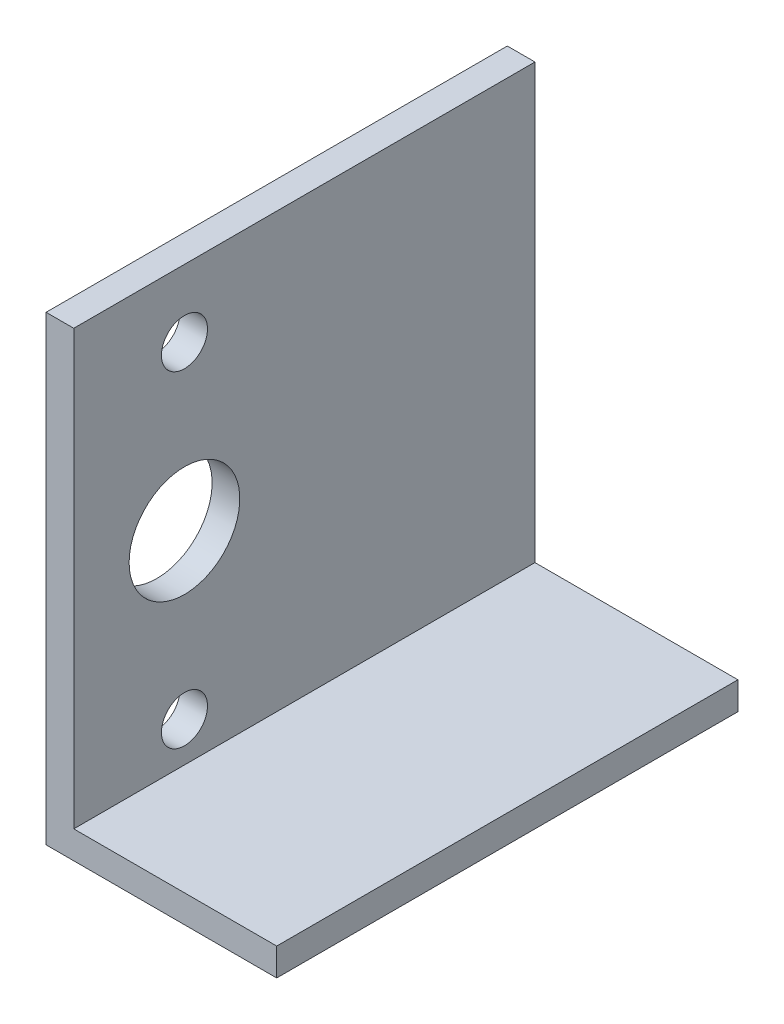
ISO-10303-21;
HEADER;
FILE_DESCRIPTION(('STEP AP214'),'2;1');
FILE_NAME('part.step','',(''),(''),'','','');
FILE_SCHEMA(('AUTOMOTIVE_DESIGN { 1 0 10303 214 1 1 1 1 }'));
ENDSEC;
DATA;
#1=APPLICATION_CONTEXT('core data for automotive mechanical design processes');
#2=APPLICATION_PROTOCOL_DEFINITION('international standard','automotive_design',2000,#1);
#3=PRODUCT_CONTEXT('',#1,'mechanical');
#4=PRODUCT('Part','Part','',(#3));
#5=PRODUCT_RELATED_PRODUCT_CATEGORY('part','',(#4));
#6=PRODUCT_DEFINITION_FORMATION('','',#4);
#7=PRODUCT_DEFINITION_CONTEXT('part definition',#1,'design');
#8=PRODUCT_DEFINITION('design','',#6,#7);
#9=PRODUCT_DEFINITION_SHAPE('','',#8);
#10=(LENGTH_UNIT() NAMED_UNIT(*) SI_UNIT(.MILLI.,.METRE.));
#11=(NAMED_UNIT(*) PLANE_ANGLE_UNIT() SI_UNIT($,.RADIAN.));
#12=(NAMED_UNIT(*) SI_UNIT($,.STERADIAN.) SOLID_ANGLE_UNIT());
#13=UNCERTAINTY_MEASURE_WITH_UNIT(LENGTH_MEASURE(1.E-05),#10,'distance_accuracy_value','');
#14=(GEOMETRIC_REPRESENTATION_CONTEXT(3) GLOBAL_UNCERTAINTY_ASSIGNED_CONTEXT((#13)) GLOBAL_UNIT_ASSIGNED_CONTEXT((#10,
#11,#12)) REPRESENTATION_CONTEXT('',''));
#15=CARTESIAN_POINT('',(0.,0.,0.));
#16=DIRECTION('',(0.,0.,1.));
#17=DIRECTION('',(1.,0.,0.));
#18=AXIS2_PLACEMENT_3D('',#15,#16,#17);
#19=CARTESIAN_POINT('',(0.,50.,50.));
#20=DIRECTION('',(0.,-1.,0.));
#21=DIRECTION('',(0.,0.,-1.));
#22=AXIS2_PLACEMENT_3D('',#19,#20,#21);
#23=PLANE('',#22);
#24=DIRECTION('',(-1.,0.,0.));
#25=VECTOR('',#24,1.);
#26=CARTESIAN_POINT('',(0.,50.,0.));
#27=LINE('',#26,#25);
#28=CARTESIAN_POINT('',(3.,50.,0.));
#29=VERTEX_POINT('',#28);
#30=CARTESIAN_POINT('',(0.,50.,0.));
#31=VERTEX_POINT('',#30);
#32=EDGE_CURVE('E120',#29,#31,#27,.T.);
#33=ORIENTED_EDGE('',*,*,#32,.T.);
#34=DIRECTION('',(0.,0.,-1.));
#35=VECTOR('',#34,1.);
#36=CARTESIAN_POINT('',(0.,50.,50.));
#37=LINE('',#36,#35);
#38=CARTESIAN_POINT('',(0.,50.,50.));
#39=VERTEX_POINT('',#38);
#40=EDGE_CURVE('E11',#39,#31,#37,.T.);
#41=ORIENTED_EDGE('',*,*,#40,.F.);
#42=DIRECTION('',(-1.,0.,0.));
#43=VECTOR('',#42,1.);
#44=CARTESIAN_POINT('',(0.,50.,50.));
#45=LINE('',#44,#43);
#46=CARTESIAN_POINT('',(3.,50.,50.));
#47=VERTEX_POINT('',#46);
#48=EDGE_CURVE('E131',#47,#39,#45,.T.);
#49=ORIENTED_EDGE('',*,*,#48,.F.);
#50=DIRECTION('',(0.,0.,-1.));
#51=VECTOR('',#50,1.);
#52=CARTESIAN_POINT('',(3.,50.,50.));
#53=LINE('',#52,#51);
#54=EDGE_CURVE('E116',#47,#29,#53,.T.);
#55=ORIENTED_EDGE('',*,*,#54,.T.);
#56=EDGE_LOOP('',(#33,#41,#49,#55));
#57=FACE_BOUND('',#56,.T.);
#58=ADVANCED_FACE('F36',(#57),#23,.F.);
#59=CARTESIAN_POINT('',(0.,50.,50.));
#60=DIRECTION('',(1.,0.,0.));
#61=DIRECTION('',(0.,0.,-1.));
#62=AXIS2_PLACEMENT_3D('',#59,#60,#61);
#63=PLANE('',#62);
#64=CARTESIAN_POINT('',(0.,7.3,38.));
#65=DIRECTION('',(-1.,0.,0.));
#66=DIRECTION('',(0.,0.,1.));
#67=AXIS2_PLACEMENT_3D('',#64,#65,#66);
#68=CIRCLE('',#67,2.5);
#69=CARTESIAN_POINT('',(0.,7.3,40.5));
#70=VERTEX_POINT('',#69);
#71=EDGE_CURVE('E240',#70,#70,#68,.T.);
#72=ORIENTED_EDGE('',*,*,#71,.F.);
#73=EDGE_LOOP('',(#72));
#74=FACE_BOUND('',#73,.T.);
#75=CARTESIAN_POINT('',(0.,42.7,38.));
#76=DIRECTION('',(-1.,0.,0.));
#77=DIRECTION('',(0.,0.,1.));
#78=AXIS2_PLACEMENT_3D('',#75,#76,#77);
#79=CIRCLE('',#78,2.5);
#80=CARTESIAN_POINT('',(0.,42.7,40.5));
#81=VERTEX_POINT('',#80);
#82=EDGE_CURVE('E242',#81,#81,#79,.T.);
#83=ORIENTED_EDGE('',*,*,#82,.F.);
#84=EDGE_LOOP('',(#83));
#85=FACE_BOUND('',#84,.T.);
#86=CARTESIAN_POINT('',(0.,25.,38.));
#87=DIRECTION('',(-1.,0.,0.));
#88=DIRECTION('',(0.,0.,1.));
#89=AXIS2_PLACEMENT_3D('',#86,#87,#88);
#90=CIRCLE('',#89,6.);
#91=CARTESIAN_POINT('',(0.,25.,44.));
#92=VERTEX_POINT('',#91);
#93=EDGE_CURVE('E248',#92,#92,#90,.T.);
#94=ORIENTED_EDGE('',*,*,#93,.F.);
#95=EDGE_LOOP('',(#94));
#96=FACE_BOUND('',#95,.T.);
#97=DIRECTION('',(0.,-1.,0.));
#98=VECTOR('',#97,1.);
#99=CARTESIAN_POINT('',(0.,50.,0.));
#100=LINE('',#99,#98);
#101=CARTESIAN_POINT('',(0.,0.,0.));
#102=VERTEX_POINT('',#101);
#103=EDGE_CURVE('E123',#31,#102,#100,.T.);
#104=ORIENTED_EDGE('',*,*,#103,.T.);
#105=DIRECTION('',(0.,0.,-1.));
#106=VECTOR('',#105,1.);
#107=CARTESIAN_POINT('',(0.,0.,50.));
#108=LINE('',#107,#106);
#109=CARTESIAN_POINT('',(0.,0.,50.));
#110=VERTEX_POINT('',#109);
#111=EDGE_CURVE('E44',#110,#102,#108,.T.);
#112=ORIENTED_EDGE('',*,*,#111,.F.);
#113=DIRECTION('',(0.,-1.,0.));
#114=VECTOR('',#113,1.);
#115=CARTESIAN_POINT('',(0.,50.,50.));
#116=LINE('',#115,#114);
#117=EDGE_CURVE('E89',#39,#110,#116,.T.);
#118=ORIENTED_EDGE('',*,*,#117,.F.);
#119=ORIENTED_EDGE('',*,*,#40,.T.);
#120=EDGE_LOOP('',(#104,#112,#118,#119));
#121=FACE_BOUND('',#120,.T.);
#122=ADVANCED_FACE('F158',(#74,#85,#96,#121),#63,.F.);
#123=CARTESIAN_POINT('',(0.,0.,50.));
#124=DIRECTION('',(0.,1.,0.));
#125=DIRECTION('',(0.,0.,1.));
#126=AXIS2_PLACEMENT_3D('',#123,#124,#125);
#127=PLANE('',#126);
#128=DIRECTION('',(1.,0.,0.));
#129=VECTOR('',#128,1.);
#130=CARTESIAN_POINT('',(0.,0.,0.));
#131=LINE('',#130,#129);
#132=CARTESIAN_POINT('',(25.,0.,0.));
#133=VERTEX_POINT('',#132);
#134=EDGE_CURVE('E126',#102,#133,#131,.T.);
#135=ORIENTED_EDGE('',*,*,#134,.T.);
#136=DIRECTION('',(0.,0.,-1.));
#137=VECTOR('',#136,1.);
#138=CARTESIAN_POINT('',(25.,0.,50.));
#139=LINE('',#138,#137);
#140=CARTESIAN_POINT('',(25.,0.,50.));
#141=VERTEX_POINT('',#140);
#142=EDGE_CURVE('E111',#141,#133,#139,.T.);
#143=ORIENTED_EDGE('',*,*,#142,.F.);
#144=DIRECTION('',(1.,0.,0.));
#145=VECTOR('',#144,1.);
#146=CARTESIAN_POINT('',(0.,0.,50.));
#147=LINE('',#146,#145);
#148=EDGE_CURVE('E102',#110,#141,#147,.T.);
#149=ORIENTED_EDGE('',*,*,#148,.F.);
#150=ORIENTED_EDGE('',*,*,#111,.T.);
#151=EDGE_LOOP('',(#135,#143,#149,#150));
#152=FACE_BOUND('',#151,.T.);
#153=ADVANCED_FACE('F137',(#152),#127,.F.);
#154=CARTESIAN_POINT('',(25.,0.,50.));
#155=DIRECTION('',(-1.,0.,0.));
#156=DIRECTION('',(0.,0.,1.));
#157=AXIS2_PLACEMENT_3D('',#154,#155,#156);
#158=PLANE('',#157);
#159=DIRECTION('',(0.,1.,0.));
#160=VECTOR('',#159,1.);
#161=CARTESIAN_POINT('',(25.,0.,0.));
#162=LINE('',#161,#160);
#163=CARTESIAN_POINT('',(25.,3.,0.));
#164=VERTEX_POINT('',#163);
#165=EDGE_CURVE('E110',#133,#164,#162,.T.);
#166=ORIENTED_EDGE('',*,*,#165,.T.);
#167=DIRECTION('',(0.,0.,-1.));
#168=VECTOR('',#167,1.);
#169=CARTESIAN_POINT('',(25.,3.,50.));
#170=LINE('',#169,#168);
#171=CARTESIAN_POINT('',(25.,3.,50.));
#172=VERTEX_POINT('',#171);
#173=EDGE_CURVE('E107',#172,#164,#170,.T.);
#174=ORIENTED_EDGE('',*,*,#173,.F.);
#175=DIRECTION('',(0.,1.,0.));
#176=VECTOR('',#175,1.);
#177=CARTESIAN_POINT('',(25.,0.,50.));
#178=LINE('',#177,#176);
#179=EDGE_CURVE('E96',#141,#172,#178,.T.);
#180=ORIENTED_EDGE('',*,*,#179,.F.);
#181=ORIENTED_EDGE('',*,*,#142,.T.);
#182=EDGE_LOOP('',(#166,#174,#180,#181));
#183=FACE_BOUND('',#182,.T.);
#184=ADVANCED_FACE('F108',(#183),#158,.F.);
#185=CARTESIAN_POINT('',(3.,3.,50.));
#186=DIRECTION('',(0.,-1.,0.));
#187=DIRECTION('',(0.,0.,-1.));
#188=AXIS2_PLACEMENT_3D('',#185,#186,#187);
#189=PLANE('',#188);
#190=DIRECTION('',(-1.,0.,0.));
#191=VECTOR('',#190,1.);
#192=CARTESIAN_POINT('',(3.,3.,0.));
#193=LINE('',#192,#191);
#194=CARTESIAN_POINT('',(3.,3.,0.));
#195=VERTEX_POINT('',#194);
#196=EDGE_CURVE('E75',#164,#195,#193,.T.);
#197=ORIENTED_EDGE('',*,*,#196,.T.);
#198=DIRECTION('',(0.,0.,-1.));
#199=VECTOR('',#198,1.);
#200=CARTESIAN_POINT('',(3.,3.,50.));
#201=LINE('',#200,#199);
#202=CARTESIAN_POINT('',(3.,3.,50.));
#203=VERTEX_POINT('',#202);
#204=EDGE_CURVE('E112',#203,#195,#201,.T.);
#205=ORIENTED_EDGE('',*,*,#204,.F.);
#206=DIRECTION('',(-1.,0.,0.));
#207=VECTOR('',#206,1.);
#208=CARTESIAN_POINT('',(3.,3.,50.));
#209=LINE('',#208,#207);
#210=EDGE_CURVE('E100',#172,#203,#209,.T.);
#211=ORIENTED_EDGE('',*,*,#210,.F.);
#212=ORIENTED_EDGE('',*,*,#173,.T.);
#213=EDGE_LOOP('',(#197,#205,#211,#212));
#214=FACE_BOUND('',#213,.T.);
#215=ADVANCED_FACE('F114',(#214),#189,.F.);
#216=CARTESIAN_POINT('',(3.,50.,50.));
#217=DIRECTION('',(-1.,0.,0.));
#218=DIRECTION('',(0.,0.,1.));
#219=AXIS2_PLACEMENT_3D('',#216,#217,#218);
#220=PLANE('',#219);
#221=CARTESIAN_POINT('',(3.,7.3,38.));
#222=DIRECTION('',(-1.,0.,0.));
#223=DIRECTION('',(0.,0.,1.));
#224=AXIS2_PLACEMENT_3D('',#221,#222,#223);
#225=CIRCLE('',#224,2.5);
#226=CARTESIAN_POINT('',(3.,7.3,40.5));
#227=VERTEX_POINT('',#226);
#228=EDGE_CURVE('E238',#227,#227,#225,.F.);
#229=ORIENTED_EDGE('',*,*,#228,.F.);
#230=EDGE_LOOP('',(#229));
#231=FACE_BOUND('',#230,.T.);
#232=CARTESIAN_POINT('',(3.,42.7,38.));
#233=DIRECTION('',(-1.,0.,0.));
#234=DIRECTION('',(0.,0.,1.));
#235=AXIS2_PLACEMENT_3D('',#232,#233,#234);
#236=CIRCLE('',#235,2.5);
#237=CARTESIAN_POINT('',(3.,42.7,40.5));
#238=VERTEX_POINT('',#237);
#239=EDGE_CURVE('E245',#238,#238,#236,.F.);
#240=ORIENTED_EDGE('',*,*,#239,.F.);
#241=EDGE_LOOP('',(#240));
#242=FACE_BOUND('',#241,.T.);
#243=CARTESIAN_POINT('',(3.,25.,38.));
#244=DIRECTION('',(-1.,0.,0.));
#245=DIRECTION('',(0.,0.,1.));
#246=AXIS2_PLACEMENT_3D('',#243,#244,#245);
#247=CIRCLE('',#246,6.);
#248=CARTESIAN_POINT('',(3.,25.,44.));
#249=VERTEX_POINT('',#248);
#250=EDGE_CURVE('E124',#249,#249,#247,.F.);
#251=ORIENTED_EDGE('',*,*,#250,.F.);
#252=EDGE_LOOP('',(#251));
#253=FACE_BOUND('',#252,.T.);
#254=DIRECTION('',(0.,1.,0.));
#255=VECTOR('',#254,1.);
#256=CARTESIAN_POINT('',(3.,50.,0.));
#257=LINE('',#256,#255);
#258=EDGE_CURVE('E81',#195,#29,#257,.T.);
#259=ORIENTED_EDGE('',*,*,#258,.T.);
#260=ORIENTED_EDGE('',*,*,#54,.F.);
#261=DIRECTION('',(0.,1.,0.));
#262=VECTOR('',#261,1.);
#263=CARTESIAN_POINT('',(3.,50.,50.));
#264=LINE('',#263,#262);
#265=EDGE_CURVE('E52',#203,#47,#264,.T.);
#266=ORIENTED_EDGE('',*,*,#265,.F.);
#267=ORIENTED_EDGE('',*,*,#204,.T.);
#268=EDGE_LOOP('',(#259,#260,#266,#267));
#269=FACE_BOUND('',#268,.T.);
#270=ADVANCED_FACE('F144',(#231,#242,#253,#269),#220,.F.);
#271=CARTESIAN_POINT('',(0.,0.,50.));
#272=DIRECTION('',(0.,0.,-1.));
#273=DIRECTION('',(-1.,0.,0.));
#274=AXIS2_PLACEMENT_3D('',#271,#272,#273);
#275=PLANE('',#274);
#276=ORIENTED_EDGE('',*,*,#48,.T.);
#277=ORIENTED_EDGE('',*,*,#117,.T.);
#278=ORIENTED_EDGE('',*,*,#148,.T.);
#279=ORIENTED_EDGE('',*,*,#179,.T.);
#280=ORIENTED_EDGE('',*,*,#210,.T.);
#281=ORIENTED_EDGE('',*,*,#265,.T.);
#282=EDGE_LOOP('',(#276,#277,#278,#279,#280,#281));
#283=FACE_BOUND('',#282,.T.);
#284=ADVANCED_FACE('F98',(#283),#275,.F.);
#285=CARTESIAN_POINT('',(0.,0.,0.));
#286=DIRECTION('',(0.,0.,-1.));
#287=DIRECTION('',(-1.,0.,0.));
#288=AXIS2_PLACEMENT_3D('',#285,#286,#287);
#289=PLANE('',#288);
#290=ORIENTED_EDGE('',*,*,#32,.F.);
#291=ORIENTED_EDGE('',*,*,#258,.F.);
#292=ORIENTED_EDGE('',*,*,#196,.F.);
#293=ORIENTED_EDGE('',*,*,#165,.F.);
#294=ORIENTED_EDGE('',*,*,#134,.F.);
#295=ORIENTED_EDGE('',*,*,#103,.F.);
#296=EDGE_LOOP('',(#290,#291,#292,#293,#294,#295));
#297=FACE_BOUND('',#296,.T.);
#298=ADVANCED_FACE('F140',(#297),#289,.T.);
#299=CARTESIAN_POINT('',(19.9705627484771,25.,38.));
#300=DIRECTION('',(-1.,0.,0.));
#301=DIRECTION('',(0.,0.,1.));
#302=AXIS2_PLACEMENT_3D('',#299,#300,#301);
#303=CYLINDRICAL_SURFACE('',#302,6.);
#304=ORIENTED_EDGE('',*,*,#250,.T.);
#305=EDGE_LOOP('',(#304));
#306=FACE_BOUND('',#305,.T.);
#307=ORIENTED_EDGE('',*,*,#93,.T.);
#308=EDGE_LOOP('',(#307));
#309=FACE_BOUND('',#308,.T.);
#310=ADVANCED_FACE('F194',(#306,#309),#303,.F.);
#311=CARTESIAN_POINT('',(19.9705627484771,42.7,38.));
#312=DIRECTION('',(-1.,0.,0.));
#313=DIRECTION('',(0.,0.,1.));
#314=AXIS2_PLACEMENT_3D('',#311,#312,#313);
#315=CYLINDRICAL_SURFACE('',#314,2.5);
#316=ORIENTED_EDGE('',*,*,#239,.T.);
#317=EDGE_LOOP('',(#316));
#318=FACE_BOUND('',#317,.T.);
#319=ORIENTED_EDGE('',*,*,#82,.T.);
#320=EDGE_LOOP('',(#319));
#321=FACE_BOUND('',#320,.T.);
#322=ADVANCED_FACE('F212',(#318,#321),#315,.F.);
#323=CARTESIAN_POINT('',(19.9705627484771,7.3,38.));
#324=DIRECTION('',(-1.,0.,0.));
#325=DIRECTION('',(0.,0.,1.));
#326=AXIS2_PLACEMENT_3D('',#323,#324,#325);
#327=CYLINDRICAL_SURFACE('',#326,2.5);
#328=ORIENTED_EDGE('',*,*,#228,.T.);
#329=EDGE_LOOP('',(#328));
#330=FACE_BOUND('',#329,.T.);
#331=ORIENTED_EDGE('',*,*,#71,.T.);
#332=EDGE_LOOP('',(#331));
#333=FACE_BOUND('',#332,.T.);
#334=ADVANCED_FACE('F222',(#330,#333),#327,.F.);
#335=CLOSED_SHELL('',(#58,#122,#153,#184,#215,#270,#284,#298,#310,#322,#334));
#336=MANIFOLD_SOLID_BREP('B2',#335);
#337=ADVANCED_BREP_SHAPE_REPRESENTATION('',(#18,#336),#14);
#338=SHAPE_DEFINITION_REPRESENTATION(#9,#337);
ENDSEC;
END-ISO-10303-21;
